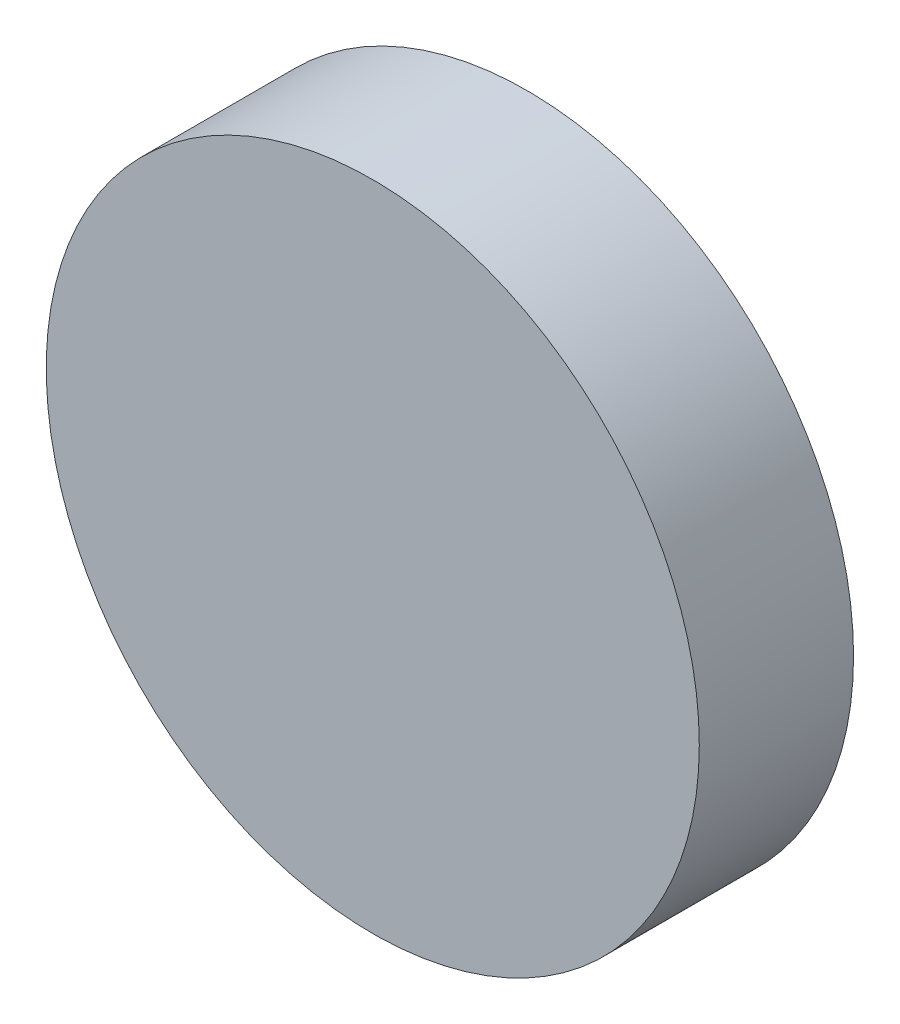
ISO-10303-21;
HEADER;
FILE_DESCRIPTION(('STEP AP214'),'2;1');
FILE_NAME('part.step','',(''),(''),'','','');
FILE_SCHEMA(('AUTOMOTIVE_DESIGN { 1 0 10303 214 1 1 1 1 }'));
ENDSEC;
DATA;
#1=APPLICATION_CONTEXT('core data for automotive mechanical design processes');
#2=APPLICATION_PROTOCOL_DEFINITION('international standard','automotive_design',2000,#1);
#3=PRODUCT_CONTEXT('',#1,'mechanical');
#4=PRODUCT('Part','Part','',(#3));
#5=PRODUCT_RELATED_PRODUCT_CATEGORY('part','',(#4));
#6=PRODUCT_DEFINITION_FORMATION('','',#4);
#7=PRODUCT_DEFINITION_CONTEXT('part definition',#1,'design');
#8=PRODUCT_DEFINITION('design','',#6,#7);
#9=PRODUCT_DEFINITION_SHAPE('','',#8);
#10=(LENGTH_UNIT() NAMED_UNIT(*) SI_UNIT(.MILLI.,.METRE.));
#11=(NAMED_UNIT(*) PLANE_ANGLE_UNIT() SI_UNIT($,.RADIAN.));
#12=(NAMED_UNIT(*) SI_UNIT($,.STERADIAN.) SOLID_ANGLE_UNIT());
#13=UNCERTAINTY_MEASURE_WITH_UNIT(LENGTH_MEASURE(1.E-05),#10,'distance_accuracy_value','');
#14=(GEOMETRIC_REPRESENTATION_CONTEXT(3) GLOBAL_UNCERTAINTY_ASSIGNED_CONTEXT((#13)) GLOBAL_UNIT_ASSIGNED_CONTEXT((#10,
#11,#12)) REPRESENTATION_CONTEXT('',''));
#15=CARTESIAN_POINT('',(0.,0.,0.));
#16=DIRECTION('',(0.,0.,1.));
#17=DIRECTION('',(1.,0.,0.));
#18=AXIS2_PLACEMENT_3D('',#15,#16,#17);
#19=CARTESIAN_POINT('',(0.,0.,3.));
#20=DIRECTION('',(0.,0.,-1.));
#21=DIRECTION('',(-1.,0.,0.));
#22=AXIS2_PLACEMENT_3D('',#19,#20,#21);
#23=CYLINDRICAL_SURFACE('',#22,6.35);
#24=CARTESIAN_POINT('',(0.,0.,3.));
#25=DIRECTION('',(0.,0.,1.));
#26=DIRECTION('',(1.,0.,0.));
#27=AXIS2_PLACEMENT_3D('',#24,#25,#26);
#28=CIRCLE('',#27,6.35);
#29=CARTESIAN_POINT('',(6.35,0.,3.));
#30=VERTEX_POINT('',#29);
#31=EDGE_CURVE('E10',#30,#30,#28,.T.);
#32=ORIENTED_EDGE('',*,*,#31,.F.);
#33=EDGE_LOOP('',(#32));
#34=FACE_BOUND('',#33,.T.);
#35=CARTESIAN_POINT('',(0.,0.,0.));
#36=DIRECTION('',(0.,0.,1.));
#37=DIRECTION('',(1.,0.,0.));
#38=AXIS2_PLACEMENT_3D('',#35,#36,#37);
#39=CIRCLE('',#38,6.35);
#40=CARTESIAN_POINT('',(6.35,0.,0.));
#41=VERTEX_POINT('',#40);
#42=EDGE_CURVE('E42',#41,#41,#39,.T.);
#43=ORIENTED_EDGE('',*,*,#42,.T.);
#44=EDGE_LOOP('',(#43));
#45=FACE_BOUND('',#44,.T.);
#46=ADVANCED_FACE('F39',(#34,#45),#23,.T.);
#47=CARTESIAN_POINT('',(0.,0.,3.));
#48=DIRECTION('',(0.,0.,1.));
#49=DIRECTION('',(1.,0.,0.));
#50=AXIS2_PLACEMENT_3D('',#47,#48,#49);
#51=PLANE('',#50);
#52=ORIENTED_EDGE('',*,*,#31,.T.);
#53=EDGE_LOOP('',(#52));
#54=FACE_BOUND('',#53,.T.);
#55=ADVANCED_FACE('F56',(#54),#51,.T.);
#56=CARTESIAN_POINT('',(0.,0.,0.));
#57=DIRECTION('',(0.,0.,1.));
#58=DIRECTION('',(1.,0.,0.));
#59=AXIS2_PLACEMENT_3D('',#56,#57,#58);
#60=PLANE('',#59);
#61=ORIENTED_EDGE('',*,*,#42,.F.);
#62=EDGE_LOOP('',(#61));
#63=FACE_BOUND('',#62,.T.);
#64=ADVANCED_FACE('F54',(#63),#60,.F.);
#65=CLOSED_SHELL('',(#46,#55,#64));
#66=MANIFOLD_SOLID_BREP('B2',#65);
#67=ADVANCED_BREP_SHAPE_REPRESENTATION('',(#18,#66),#14);
#68=SHAPE_DEFINITION_REPRESENTATION(#9,#67);
ENDSEC;
END-ISO-10303-21;
